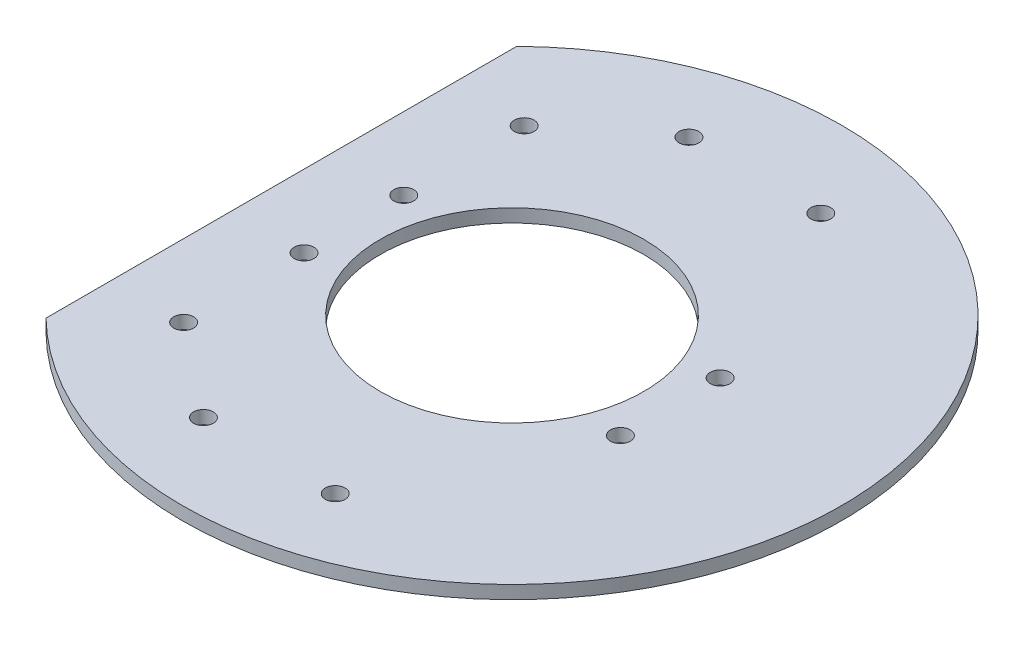
ISO-10303-21;
HEADER;
FILE_DESCRIPTION(('STEP AP214'),'2;1');
FILE_NAME('part.step','',(''),(''),'','','');
FILE_SCHEMA(('AUTOMOTIVE_DESIGN { 1 0 10303 214 1 1 1 1 }'));
ENDSEC;
DATA;
#1=APPLICATION_CONTEXT('core data for automotive mechanical design processes');
#2=APPLICATION_PROTOCOL_DEFINITION('international standard','automotive_design',2000,#1);
#3=PRODUCT_CONTEXT('',#1,'mechanical');
#4=PRODUCT('Part','Part','',(#3));
#5=PRODUCT_RELATED_PRODUCT_CATEGORY('part','',(#4));
#6=PRODUCT_DEFINITION_FORMATION('','',#4);
#7=PRODUCT_DEFINITION_CONTEXT('part definition',#1,'design');
#8=PRODUCT_DEFINITION('design','',#6,#7);
#9=PRODUCT_DEFINITION_SHAPE('','',#8);
#10=(LENGTH_UNIT() NAMED_UNIT(*) SI_UNIT(.MILLI.,.METRE.));
#11=(NAMED_UNIT(*) PLANE_ANGLE_UNIT() SI_UNIT($,.RADIAN.));
#12=(NAMED_UNIT(*) SI_UNIT($,.STERADIAN.) SOLID_ANGLE_UNIT());
#13=UNCERTAINTY_MEASURE_WITH_UNIT(LENGTH_MEASURE(1.E-05),#10,'distance_accuracy_value','');
#14=(GEOMETRIC_REPRESENTATION_CONTEXT(3) GLOBAL_UNCERTAINTY_ASSIGNED_CONTEXT((#13)) GLOBAL_UNIT_ASSIGNED_CONTEXT((#10,
#11,#12)) REPRESENTATION_CONTEXT('',''));
#15=CARTESIAN_POINT('',(0.,0.,0.));
#16=DIRECTION('',(0.,0.,1.));
#17=DIRECTION('',(1.,0.,0.));
#18=AXIS2_PLACEMENT_3D('',#15,#16,#17);
#19=CARTESIAN_POINT('',(0.,2.,0.));
#20=DIRECTION('',(0.,1.,0.));
#21=DIRECTION('',(0.,0.,1.));
#22=AXIS2_PLACEMENT_3D('',#19,#20,#21);
#23=PLANE('',#22);
#24=CARTESIAN_POINT('',(24.0092394199732,2.,7.56558269502679));
#25=DIRECTION('',(0.,-1.,0.));
#26=DIRECTION('',(0.,0.,-1.));
#27=AXIS2_PLACEMENT_3D('',#24,#25,#26);
#28=CIRCLE('',#27,1.5);
#29=CARTESIAN_POINT('',(24.0092394199732,2.,6.06558269502678));
#30=VERTEX_POINT('',#29);
#31=EDGE_CURVE('E171',#30,#30,#28,.T.);
#32=ORIENTED_EDGE('',*,*,#31,.T.);
#33=EDGE_LOOP('',(#32));
#34=FACE_BOUND('',#33,.T.);
#35=CARTESIAN_POINT('',(-23.9907605800268,2.,-25.8344173049732));
#36=DIRECTION('',(0.,-1.,0.));
#37=DIRECTION('',(0.,0.,-1.));
#38=AXIS2_PLACEMENT_3D('',#35,#36,#37);
#39=CIRCLE('',#38,1.5);
#40=CARTESIAN_POINT('',(-23.9907605800268,2.,-27.3344173049732));
#41=VERTEX_POINT('',#40);
#42=EDGE_CURVE('E163',#41,#41,#39,.T.);
#43=ORIENTED_EDGE('',*,*,#42,.T.);
#44=EDGE_LOOP('',(#43));
#45=FACE_BOUND('',#44,.T.);
#46=CARTESIAN_POINT('',(-9.99076058002677,2.,-36.8344173049732));
#47=DIRECTION('',(0.,-1.,0.));
#48=DIRECTION('',(0.,0.,-1.));
#49=AXIS2_PLACEMENT_3D('',#46,#47,#48);
#50=CIRCLE('',#49,1.5);
#51=CARTESIAN_POINT('',(-9.99076058002677,2.,-38.3344173049732));
#52=VERTEX_POINT('',#51);
#53=EDGE_CURVE('E155',#52,#52,#50,.T.);
#54=ORIENTED_EDGE('',*,*,#53,.T.);
#55=EDGE_LOOP('',(#54));
#56=FACE_BOUND('',#55,.T.);
#57=CARTESIAN_POINT('',(10.0092394199732,2.,-36.8344173049732));
#58=DIRECTION('',(0.,-1.,0.));
#59=DIRECTION('',(0.,0.,-1.));
#60=AXIS2_PLACEMENT_3D('',#57,#58,#59);
#61=CIRCLE('',#60,1.5);
#62=CARTESIAN_POINT('',(10.0092394199732,2.,-38.3344173049732));
#63=VERTEX_POINT('',#62);
#64=EDGE_CURVE('E147',#63,#63,#61,.T.);
#65=ORIENTED_EDGE('',*,*,#64,.T.);
#66=EDGE_LOOP('',(#65));
#67=FACE_BOUND('',#66,.T.);
#68=CARTESIAN_POINT('',(-23.9907605800268,2.,7.56558269502679));
#69=DIRECTION('',(0.,-1.,0.));
#70=DIRECTION('',(0.,0.,-1.));
#71=AXIS2_PLACEMENT_3D('',#68,#69,#70);
#72=CIRCLE('',#71,1.5);
#73=CARTESIAN_POINT('',(-23.9907605800268,2.,6.06558269502678));
#74=VERTEX_POINT('',#73);
#75=EDGE_CURVE('E139',#74,#74,#72,.T.);
#76=ORIENTED_EDGE('',*,*,#75,.T.);
#77=EDGE_LOOP('',(#76));
#78=FACE_BOUND('',#77,.T.);
#79=CARTESIAN_POINT('',(24.0092394199732,2.,-7.56558269502679));
#80=DIRECTION('',(0.,1.,0.));
#81=DIRECTION('',(0.,0.,1.));
#82=AXIS2_PLACEMENT_3D('',#79,#80,#81);
#83=CIRCLE('',#82,1.5);
#84=CARTESIAN_POINT('',(24.0092394199732,2.,-6.06558269502678));
#85=VERTEX_POINT('',#84);
#86=EDGE_CURVE('E103',#85,#85,#83,.T.);
#87=ORIENTED_EDGE('',*,*,#86,.F.);
#88=EDGE_LOOP('',(#87));
#89=FACE_BOUND('',#88,.T.);
#90=CARTESIAN_POINT('',(-23.9907605800268,2.,25.8344173049732));
#91=DIRECTION('',(0.,1.,0.));
#92=DIRECTION('',(0.,0.,1.));
#93=AXIS2_PLACEMENT_3D('',#90,#91,#92);
#94=CIRCLE('',#93,1.5);
#95=CARTESIAN_POINT('',(-23.9907605800268,2.,27.3344173049732));
#96=VERTEX_POINT('',#95);
#97=EDGE_CURVE('E128',#96,#96,#94,.T.);
#98=ORIENTED_EDGE('',*,*,#97,.F.);
#99=EDGE_LOOP('',(#98));
#100=FACE_BOUND('',#99,.T.);
#101=CARTESIAN_POINT('',(-9.99076058002677,2.,36.8344173049732));
#102=DIRECTION('',(0.,1.,0.));
#103=DIRECTION('',(0.,0.,1.));
#104=AXIS2_PLACEMENT_3D('',#101,#102,#103);
#105=CIRCLE('',#104,1.5);
#106=CARTESIAN_POINT('',(-9.99076058002677,2.,38.3344173049732));
#107=VERTEX_POINT('',#106);
#108=EDGE_CURVE('E120',#107,#107,#105,.T.);
#109=ORIENTED_EDGE('',*,*,#108,.F.);
#110=EDGE_LOOP('',(#109));
#111=FACE_BOUND('',#110,.T.);
#112=CARTESIAN_POINT('',(10.0092394199732,2.,36.8344173049732));
#113=DIRECTION('',(0.,1.,0.));
#114=DIRECTION('',(0.,0.,1.));
#115=AXIS2_PLACEMENT_3D('',#112,#113,#114);
#116=CIRCLE('',#115,1.5);
#117=CARTESIAN_POINT('',(10.0092394199732,2.,38.3344173049732));
#118=VERTEX_POINT('',#117);
#119=EDGE_CURVE('E111',#118,#118,#116,.T.);
#120=ORIENTED_EDGE('',*,*,#119,.F.);
#121=EDGE_LOOP('',(#120));
#122=FACE_BOUND('',#121,.T.);
#123=CARTESIAN_POINT('',(-23.9907605800268,2.,-7.56558269502679));
#124=DIRECTION('',(0.,1.,0.));
#125=DIRECTION('',(0.,0.,1.));
#126=AXIS2_PLACEMENT_3D('',#123,#124,#125);
#127=CIRCLE('',#126,1.5);
#128=CARTESIAN_POINT('',(-23.9907605800268,2.,-6.06558269502678));
#129=VERTEX_POINT('',#128);
#130=EDGE_CURVE('E99',#129,#129,#127,.T.);
#131=ORIENTED_EDGE('',*,*,#130,.F.);
#132=EDGE_LOOP('',(#131));
#133=FACE_BOUND('',#132,.T.);
#134=CARTESIAN_POINT('',(0.,2.,0.));
#135=DIRECTION('',(0.,1.,0.));
#136=DIRECTION('',(0.,0.,1.));
#137=AXIS2_PLACEMENT_3D('',#134,#135,#136);
#138=CIRCLE('',#137,50.);
#139=CARTESIAN_POINT('',(-35.,2.,35.7071421427143));
#140=VERTEX_POINT('',#139);
#141=CARTESIAN_POINT('',(-35.,2.,-35.7071421427143));
#142=VERTEX_POINT('',#141);
#143=EDGE_CURVE('E76',#140,#142,#138,.T.);
#144=ORIENTED_EDGE('',*,*,#143,.T.);
#145=DIRECTION('',(0.,0.,1.));
#146=VECTOR('',#145,1.);
#147=CARTESIAN_POINT('',(-35.,2.,-35.7071421427143));
#148=LINE('',#147,#146);
#149=EDGE_CURVE('E60',#142,#140,#148,.T.);
#150=ORIENTED_EDGE('',*,*,#149,.T.);
#151=EDGE_LOOP('',(#144,#150));
#152=FACE_BOUND('',#151,.T.);
#153=CARTESIAN_POINT('',(0.,2.,0.));
#154=DIRECTION('',(0.,1.,0.));
#155=DIRECTION('',(0.,0.,1.));
#156=AXIS2_PLACEMENT_3D('',#153,#154,#155);
#157=CIRCLE('',#156,20.);
#158=CARTESIAN_POINT('',(0.,2.,20.));
#159=VERTEX_POINT('',#158);
#160=EDGE_CURVE('E84',#159,#159,#157,.T.);
#161=ORIENTED_EDGE('',*,*,#160,.F.);
#162=EDGE_LOOP('',(#161));
#163=FACE_BOUND('',#162,.T.);
#164=ADVANCED_FACE('F43',(#34,#45,#56,#67,#78,#89,#100,#111,#122,#133,#152,#163),#23,.T.);
#165=CARTESIAN_POINT('',(0.,0.,0.));
#166=DIRECTION('',(0.,1.,0.));
#167=DIRECTION('',(0.,0.,1.));
#168=AXIS2_PLACEMENT_3D('',#165,#166,#167);
#169=PLANE('',#168);
#170=CARTESIAN_POINT('',(24.0092394199732,0.,7.56558269502679));
#171=DIRECTION('',(0.,-1.,0.));
#172=DIRECTION('',(0.,0.,-1.));
#173=AXIS2_PLACEMENT_3D('',#170,#171,#172);
#174=CIRCLE('',#173,1.5);
#175=CARTESIAN_POINT('',(24.0092394199732,0.,6.06558269502678));
#176=VERTEX_POINT('',#175);
#177=EDGE_CURVE('E143',#176,#176,#174,.T.);
#178=ORIENTED_EDGE('',*,*,#177,.F.);
#179=EDGE_LOOP('',(#178));
#180=FACE_BOUND('',#179,.T.);
#181=CARTESIAN_POINT('',(-23.9907605800268,0.,-25.8344173049732));
#182=DIRECTION('',(0.,-1.,0.));
#183=DIRECTION('',(0.,0.,-1.));
#184=AXIS2_PLACEMENT_3D('',#181,#182,#183);
#185=CIRCLE('',#184,1.5);
#186=CARTESIAN_POINT('',(-23.9907605800268,0.,-27.3344173049732));
#187=VERTEX_POINT('',#186);
#188=EDGE_CURVE('E167',#187,#187,#185,.T.);
#189=ORIENTED_EDGE('',*,*,#188,.F.);
#190=EDGE_LOOP('',(#189));
#191=FACE_BOUND('',#190,.T.);
#192=CARTESIAN_POINT('',(-9.99076058002677,0.,-36.8344173049732));
#193=DIRECTION('',(0.,-1.,0.));
#194=DIRECTION('',(0.,0.,-1.));
#195=AXIS2_PLACEMENT_3D('',#192,#193,#194);
#196=CIRCLE('',#195,1.5);
#197=CARTESIAN_POINT('',(-9.99076058002677,0.,-38.3344173049732));
#198=VERTEX_POINT('',#197);
#199=EDGE_CURVE('E159',#198,#198,#196,.T.);
#200=ORIENTED_EDGE('',*,*,#199,.F.);
#201=EDGE_LOOP('',(#200));
#202=FACE_BOUND('',#201,.T.);
#203=CARTESIAN_POINT('',(10.0092394199732,0.,-36.8344173049732));
#204=DIRECTION('',(0.,-1.,0.));
#205=DIRECTION('',(0.,0.,-1.));
#206=AXIS2_PLACEMENT_3D('',#203,#204,#205);
#207=CIRCLE('',#206,1.5);
#208=CARTESIAN_POINT('',(10.0092394199732,0.,-38.3344173049732));
#209=VERTEX_POINT('',#208);
#210=EDGE_CURVE('E151',#209,#209,#207,.T.);
#211=ORIENTED_EDGE('',*,*,#210,.F.);
#212=EDGE_LOOP('',(#211));
#213=FACE_BOUND('',#212,.T.);
#214=CARTESIAN_POINT('',(-23.9907605800268,0.,7.56558269502679));
#215=DIRECTION('',(0.,-1.,0.));
#216=DIRECTION('',(0.,0.,-1.));
#217=AXIS2_PLACEMENT_3D('',#214,#215,#216);
#218=CIRCLE('',#217,1.5);
#219=CARTESIAN_POINT('',(-23.9907605800268,0.,6.06558269502678));
#220=VERTEX_POINT('',#219);
#221=EDGE_CURVE('E112',#220,#220,#218,.T.);
#222=ORIENTED_EDGE('',*,*,#221,.F.);
#223=EDGE_LOOP('',(#222));
#224=FACE_BOUND('',#223,.T.);
#225=CARTESIAN_POINT('',(24.0092394199732,0.,-7.56558269502679));
#226=DIRECTION('',(0.,1.,0.));
#227=DIRECTION('',(0.,0.,1.));
#228=AXIS2_PLACEMENT_3D('',#225,#226,#227);
#229=CIRCLE('',#228,1.5);
#230=CARTESIAN_POINT('',(24.0092394199732,0.,-6.06558269502678));
#231=VERTEX_POINT('',#230);
#232=EDGE_CURVE('E132',#231,#231,#229,.T.);
#233=ORIENTED_EDGE('',*,*,#232,.T.);
#234=EDGE_LOOP('',(#233));
#235=FACE_BOUND('',#234,.T.);
#236=CARTESIAN_POINT('',(-23.9907605800268,0.,25.8344173049732));
#237=DIRECTION('',(0.,1.,0.));
#238=DIRECTION('',(0.,0.,1.));
#239=AXIS2_PLACEMENT_3D('',#236,#237,#238);
#240=CIRCLE('',#239,1.5);
#241=CARTESIAN_POINT('',(-23.9907605800268,0.,27.3344173049732));
#242=VERTEX_POINT('',#241);
#243=EDGE_CURVE('E124',#242,#242,#240,.T.);
#244=ORIENTED_EDGE('',*,*,#243,.T.);
#245=EDGE_LOOP('',(#244));
#246=FACE_BOUND('',#245,.T.);
#247=CARTESIAN_POINT('',(-9.99076058002677,0.,36.8344173049732));
#248=DIRECTION('',(0.,1.,0.));
#249=DIRECTION('',(0.,0.,1.));
#250=AXIS2_PLACEMENT_3D('',#247,#248,#249);
#251=CIRCLE('',#250,1.5);
#252=CARTESIAN_POINT('',(-9.99076058002677,0.,38.3344173049732));
#253=VERTEX_POINT('',#252);
#254=EDGE_CURVE('E116',#253,#253,#251,.T.);
#255=ORIENTED_EDGE('',*,*,#254,.T.);
#256=EDGE_LOOP('',(#255));
#257=FACE_BOUND('',#256,.T.);
#258=CARTESIAN_POINT('',(10.0092394199732,0.,36.8344173049732));
#259=DIRECTION('',(0.,1.,0.));
#260=DIRECTION('',(0.,0.,1.));
#261=AXIS2_PLACEMENT_3D('',#258,#259,#260);
#262=CIRCLE('',#261,1.5);
#263=CARTESIAN_POINT('',(10.0092394199732,0.,38.3344173049732));
#264=VERTEX_POINT('',#263);
#265=EDGE_CURVE('E107',#264,#264,#262,.T.);
#266=ORIENTED_EDGE('',*,*,#265,.T.);
#267=EDGE_LOOP('',(#266));
#268=FACE_BOUND('',#267,.T.);
#269=CARTESIAN_POINT('',(-23.9907605800268,0.,-7.56558269502679));
#270=DIRECTION('',(0.,1.,0.));
#271=DIRECTION('',(0.,0.,1.));
#272=AXIS2_PLACEMENT_3D('',#269,#270,#271);
#273=CIRCLE('',#272,1.5);
#274=CARTESIAN_POINT('',(-23.9907605800268,0.,-6.06558269502678));
#275=VERTEX_POINT('',#274);
#276=EDGE_CURVE('E97',#275,#275,#273,.T.);
#277=ORIENTED_EDGE('',*,*,#276,.T.);
#278=EDGE_LOOP('',(#277));
#279=FACE_BOUND('',#278,.T.);
#280=CARTESIAN_POINT('',(0.,0.,0.));
#281=DIRECTION('',(0.,1.,0.));
#282=DIRECTION('',(0.,0.,1.));
#283=AXIS2_PLACEMENT_3D('',#280,#281,#282);
#284=CIRCLE('',#283,50.);
#285=CARTESIAN_POINT('',(-35.,0.,35.7071421427143));
#286=VERTEX_POINT('',#285);
#287=CARTESIAN_POINT('',(-35.,0.,-35.7071421427143));
#288=VERTEX_POINT('',#287);
#289=EDGE_CURVE('E77',#286,#288,#284,.T.);
#290=ORIENTED_EDGE('',*,*,#289,.F.);
#291=DIRECTION('',(0.,0.,1.));
#292=VECTOR('',#291,1.);
#293=CARTESIAN_POINT('',(-35.,0.,-35.7071421427143));
#294=LINE('',#293,#292);
#295=EDGE_CURVE('E68',#288,#286,#294,.T.);
#296=ORIENTED_EDGE('',*,*,#295,.F.);
#297=EDGE_LOOP('',(#290,#296));
#298=FACE_BOUND('',#297,.T.);
#299=CARTESIAN_POINT('',(0.,0.,0.));
#300=DIRECTION('',(0.,1.,0.));
#301=DIRECTION('',(0.,0.,1.));
#302=AXIS2_PLACEMENT_3D('',#299,#300,#301);
#303=CIRCLE('',#302,20.);
#304=CARTESIAN_POINT('',(0.,0.,20.));
#305=VERTEX_POINT('',#304);
#306=EDGE_CURVE('E88',#305,#305,#303,.T.);
#307=ORIENTED_EDGE('',*,*,#306,.T.);
#308=EDGE_LOOP('',(#307));
#309=FACE_BOUND('',#308,.T.);
#310=ADVANCED_FACE('F81',(#180,#191,#202,#213,#224,#235,#246,#257,#268,#279,#298,#309),#169,.F.);
#311=CARTESIAN_POINT('',(0.,2.,0.));
#312=DIRECTION('',(0.,-1.,0.));
#313=DIRECTION('',(0.,0.,-1.));
#314=AXIS2_PLACEMENT_3D('',#311,#312,#313);
#315=CYLINDRICAL_SURFACE('',#314,50.);
#316=ORIENTED_EDGE('',*,*,#289,.T.);
#317=DIRECTION('',(0.,-1.,0.));
#318=VECTOR('',#317,1.);
#319=CARTESIAN_POINT('',(-35.,2.,-35.7071421427143));
#320=LINE('',#319,#318);
#321=EDGE_CURVE('E11',#142,#288,#320,.T.);
#322=ORIENTED_EDGE('',*,*,#321,.F.);
#323=ORIENTED_EDGE('',*,*,#143,.F.);
#324=DIRECTION('',(0.,-1.,0.));
#325=VECTOR('',#324,1.);
#326=CARTESIAN_POINT('',(-35.,2.,35.7071421427143));
#327=LINE('',#326,#325);
#328=EDGE_CURVE('E53',#140,#286,#327,.T.);
#329=ORIENTED_EDGE('',*,*,#328,.T.);
#330=EDGE_LOOP('',(#316,#322,#323,#329));
#331=FACE_BOUND('',#330,.T.);
#332=ADVANCED_FACE('F45',(#331),#315,.T.);
#333=CARTESIAN_POINT('',(-35.,2.,-35.7071421427143));
#334=DIRECTION('',(1.,0.,0.));
#335=DIRECTION('',(0.,0.,-1.));
#336=AXIS2_PLACEMENT_3D('',#333,#334,#335);
#337=PLANE('',#336);
#338=ORIENTED_EDGE('',*,*,#295,.T.);
#339=ORIENTED_EDGE('',*,*,#328,.F.);
#340=ORIENTED_EDGE('',*,*,#149,.F.);
#341=ORIENTED_EDGE('',*,*,#321,.T.);
#342=EDGE_LOOP('',(#338,#339,#340,#341));
#343=FACE_BOUND('',#342,.T.);
#344=ADVANCED_FACE('F71',(#343),#337,.F.);
#345=CARTESIAN_POINT('',(0.,2.,0.));
#346=DIRECTION('',(0.,-1.,0.));
#347=DIRECTION('',(0.,0.,-1.));
#348=AXIS2_PLACEMENT_3D('',#345,#346,#347);
#349=CYLINDRICAL_SURFACE('',#348,20.);
#350=ORIENTED_EDGE('',*,*,#160,.T.);
#351=EDGE_LOOP('',(#350));
#352=FACE_BOUND('',#351,.T.);
#353=ORIENTED_EDGE('',*,*,#306,.F.);
#354=EDGE_LOOP('',(#353));
#355=FACE_BOUND('',#354,.T.);
#356=ADVANCED_FACE('F207',(#352,#355),#349,.F.);
#357=CARTESIAN_POINT('',(-23.9907605800268,0.,-7.56558269502679));
#358=DIRECTION('',(0.,1.,0.));
#359=DIRECTION('',(0.,0.,1.));
#360=AXIS2_PLACEMENT_3D('',#357,#358,#359);
#361=CYLINDRICAL_SURFACE('',#360,1.5);
#362=ORIENTED_EDGE('',*,*,#276,.F.);
#363=EDGE_LOOP('',(#362));
#364=FACE_BOUND('',#363,.T.);
#365=ORIENTED_EDGE('',*,*,#130,.T.);
#366=EDGE_LOOP('',(#365));
#367=FACE_BOUND('',#366,.T.);
#368=ADVANCED_FACE('F203',(#364,#367),#361,.F.);
#369=CARTESIAN_POINT('',(10.0092394199732,0.,36.8344173049732));
#370=DIRECTION('',(0.,1.,0.));
#371=DIRECTION('',(0.,0.,1.));
#372=AXIS2_PLACEMENT_3D('',#369,#370,#371);
#373=CYLINDRICAL_SURFACE('',#372,1.5);
#374=ORIENTED_EDGE('',*,*,#265,.F.);
#375=EDGE_LOOP('',(#374));
#376=FACE_BOUND('',#375,.T.);
#377=ORIENTED_EDGE('',*,*,#119,.T.);
#378=EDGE_LOOP('',(#377));
#379=FACE_BOUND('',#378,.T.);
#380=ADVANCED_FACE('F206',(#376,#379),#373,.F.);
#381=CARTESIAN_POINT('',(-9.99076058002677,0.,36.8344173049732));
#382=DIRECTION('',(0.,1.,0.));
#383=DIRECTION('',(0.,0.,1.));
#384=AXIS2_PLACEMENT_3D('',#381,#382,#383);
#385=CYLINDRICAL_SURFACE('',#384,1.5);
#386=ORIENTED_EDGE('',*,*,#254,.F.);
#387=EDGE_LOOP('',(#386));
#388=FACE_BOUND('',#387,.T.);
#389=ORIENTED_EDGE('',*,*,#108,.T.);
#390=EDGE_LOOP('',(#389));
#391=FACE_BOUND('',#390,.T.);
#392=ADVANCED_FACE('F227',(#388,#391),#385,.F.);
#393=CARTESIAN_POINT('',(-23.9907605800268,0.,25.8344173049732));
#394=DIRECTION('',(0.,1.,0.));
#395=DIRECTION('',(0.,0.,1.));
#396=AXIS2_PLACEMENT_3D('',#393,#394,#395);
#397=CYLINDRICAL_SURFACE('',#396,1.5);
#398=ORIENTED_EDGE('',*,*,#243,.F.);
#399=EDGE_LOOP('',(#398));
#400=FACE_BOUND('',#399,.T.);
#401=ORIENTED_EDGE('',*,*,#97,.T.);
#402=EDGE_LOOP('',(#401));
#403=FACE_BOUND('',#402,.T.);
#404=ADVANCED_FACE('F231',(#400,#403),#397,.F.);
#405=CARTESIAN_POINT('',(24.0092394199732,0.,-7.56558269502679));
#406=DIRECTION('',(0.,1.,0.));
#407=DIRECTION('',(0.,0.,1.));
#408=AXIS2_PLACEMENT_3D('',#405,#406,#407);
#409=CYLINDRICAL_SURFACE('',#408,1.5);
#410=ORIENTED_EDGE('',*,*,#232,.F.);
#411=EDGE_LOOP('',(#410));
#412=FACE_BOUND('',#411,.T.);
#413=ORIENTED_EDGE('',*,*,#86,.T.);
#414=EDGE_LOOP('',(#413));
#415=FACE_BOUND('',#414,.T.);
#416=ADVANCED_FACE('F235',(#412,#415),#409,.F.);
#417=CARTESIAN_POINT('',(-23.9907605800268,0.,7.56558269502679));
#418=DIRECTION('',(0.,1.,0.));
#419=DIRECTION('',(0.,0.,1.));
#420=AXIS2_PLACEMENT_3D('',#417,#418,#419);
#421=CYLINDRICAL_SURFACE('',#420,1.5);
#422=ORIENTED_EDGE('',*,*,#221,.T.);
#423=EDGE_LOOP('',(#422));
#424=FACE_BOUND('',#423,.T.);
#425=ORIENTED_EDGE('',*,*,#75,.F.);
#426=EDGE_LOOP('',(#425));
#427=FACE_BOUND('',#426,.T.);
#428=ADVANCED_FACE('F239',(#424,#427),#421,.F.);
#429=CARTESIAN_POINT('',(10.0092394199732,0.,-36.8344173049732));
#430=DIRECTION('',(0.,1.,0.));
#431=DIRECTION('',(0.,0.,1.));
#432=AXIS2_PLACEMENT_3D('',#429,#430,#431);
#433=CYLINDRICAL_SURFACE('',#432,1.5);
#434=ORIENTED_EDGE('',*,*,#210,.T.);
#435=EDGE_LOOP('',(#434));
#436=FACE_BOUND('',#435,.T.);
#437=ORIENTED_EDGE('',*,*,#64,.F.);
#438=EDGE_LOOP('',(#437));
#439=FACE_BOUND('',#438,.T.);
#440=ADVANCED_FACE('F243',(#436,#439),#433,.F.);
#441=CARTESIAN_POINT('',(-9.99076058002677,0.,-36.8344173049732));
#442=DIRECTION('',(0.,1.,0.));
#443=DIRECTION('',(0.,0.,1.));
#444=AXIS2_PLACEMENT_3D('',#441,#442,#443);
#445=CYLINDRICAL_SURFACE('',#444,1.5);
#446=ORIENTED_EDGE('',*,*,#199,.T.);
#447=EDGE_LOOP('',(#446));
#448=FACE_BOUND('',#447,.T.);
#449=ORIENTED_EDGE('',*,*,#53,.F.);
#450=EDGE_LOOP('',(#449));
#451=FACE_BOUND('',#450,.T.);
#452=ADVANCED_FACE('F247',(#448,#451),#445,.F.);
#453=CARTESIAN_POINT('',(-23.9907605800268,0.,-25.8344173049732));
#454=DIRECTION('',(0.,1.,0.));
#455=DIRECTION('',(0.,0.,1.));
#456=AXIS2_PLACEMENT_3D('',#453,#454,#455);
#457=CYLINDRICAL_SURFACE('',#456,1.5);
#458=ORIENTED_EDGE('',*,*,#188,.T.);
#459=EDGE_LOOP('',(#458));
#460=FACE_BOUND('',#459,.T.);
#461=ORIENTED_EDGE('',*,*,#42,.F.);
#462=EDGE_LOOP('',(#461));
#463=FACE_BOUND('',#462,.T.);
#464=ADVANCED_FACE('F251',(#460,#463),#457,.F.);
#465=CARTESIAN_POINT('',(24.0092394199732,0.,7.56558269502679));
#466=DIRECTION('',(0.,1.,0.));
#467=DIRECTION('',(0.,0.,1.));
#468=AXIS2_PLACEMENT_3D('',#465,#466,#467);
#469=CYLINDRICAL_SURFACE('',#468,1.5);
#470=ORIENTED_EDGE('',*,*,#177,.T.);
#471=EDGE_LOOP('',(#470));
#472=FACE_BOUND('',#471,.T.);
#473=ORIENTED_EDGE('',*,*,#31,.F.);
#474=EDGE_LOOP('',(#473));
#475=FACE_BOUND('',#474,.T.);
#476=ADVANCED_FACE('F179',(#472,#475),#469,.F.);
#477=CLOSED_SHELL('',(#164,#310,#332,#344,#356,#368,#380,#392,#404,#416,#428,#440,#452,#464,#476));
#478=MANIFOLD_SOLID_BREP('B2',#477);
#479=ADVANCED_BREP_SHAPE_REPRESENTATION('',(#18,#478),#14);
#480=SHAPE_DEFINITION_REPRESENTATION(#9,#479);
ENDSEC;
END-ISO-10303-21;
